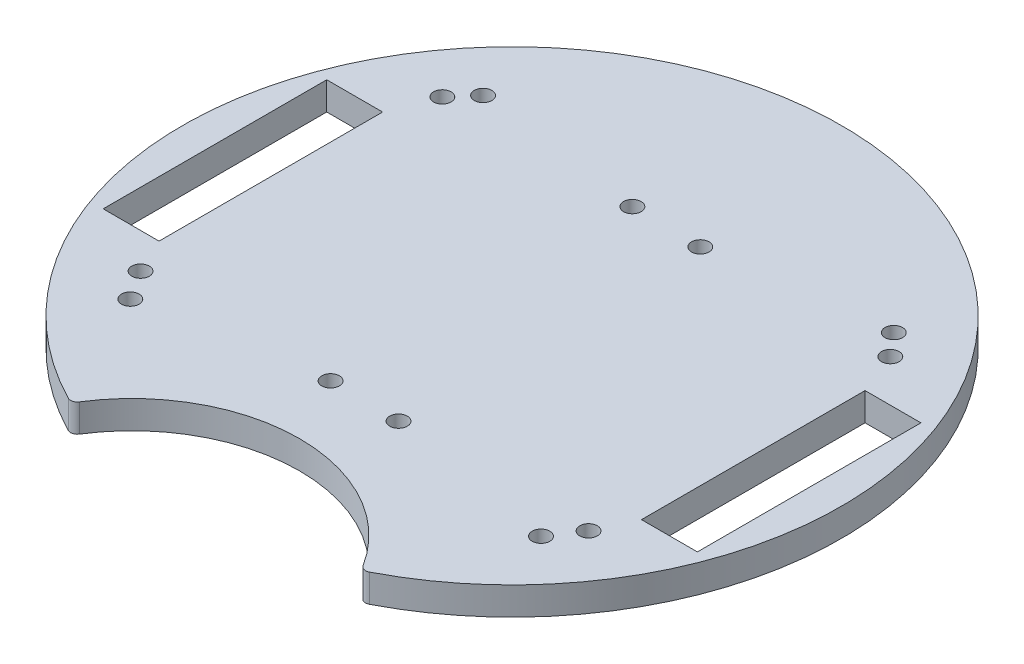
ISO-10303-21;
HEADER;
FILE_DESCRIPTION(('STEP AP214'),'2;1');
FILE_NAME('part.step','',(''),(''),'','','');
FILE_SCHEMA(('AUTOMOTIVE_DESIGN { 1 0 10303 214 1 1 1 1 }'));
ENDSEC;
DATA;
#1=APPLICATION_CONTEXT('core data for automotive mechanical design processes');
#2=APPLICATION_PROTOCOL_DEFINITION('international standard','automotive_design',2000,#1);
#3=PRODUCT_CONTEXT('',#1,'mechanical');
#4=PRODUCT('Part','Part','',(#3));
#5=PRODUCT_RELATED_PRODUCT_CATEGORY('part','',(#4));
#6=PRODUCT_DEFINITION_FORMATION('','',#4);
#7=PRODUCT_DEFINITION_CONTEXT('part definition',#1,'design');
#8=PRODUCT_DEFINITION('design','',#6,#7);
#9=PRODUCT_DEFINITION_SHAPE('','',#8);
#10=(LENGTH_UNIT() NAMED_UNIT(*) SI_UNIT(.MILLI.,.METRE.));
#11=(NAMED_UNIT(*) PLANE_ANGLE_UNIT() SI_UNIT($,.RADIAN.));
#12=(NAMED_UNIT(*) SI_UNIT($,.STERADIAN.) SOLID_ANGLE_UNIT());
#13=UNCERTAINTY_MEASURE_WITH_UNIT(LENGTH_MEASURE(1.E-05),#10,'distance_accuracy_value','');
#14=(GEOMETRIC_REPRESENTATION_CONTEXT(3) GLOBAL_UNCERTAINTY_ASSIGNED_CONTEXT((#13)) GLOBAL_UNIT_ASSIGNED_CONTEXT((#10,
#11,#12)) REPRESENTATION_CONTEXT('',''));
#15=CARTESIAN_POINT('',(0.,0.,0.));
#16=DIRECTION('',(0.,0.,1.));
#17=DIRECTION('',(1.,0.,0.));
#18=AXIS2_PLACEMENT_3D('',#15,#16,#17);
#19=CARTESIAN_POINT('',(67.5141237268841,6.35,0.));
#20=DIRECTION('',(-1.,0.,0.));
#21=DIRECTION('',(0.,0.,1.));
#22=AXIS2_PLACEMENT_3D('',#19,#20,#21);
#23=PLANE('',#22);
#24=DIRECTION('',(0.,0.,-1.));
#25=VECTOR('',#24,1.);
#26=CARTESIAN_POINT('',(67.5141237268841,0.,0.));
#27=LINE('',#26,#25);
#28=CARTESIAN_POINT('',(67.5141237268841,0.,25.3999999999999));
#29=VERTEX_POINT('',#28);
#30=CARTESIAN_POINT('',(67.5141237268841,0.,-25.4000000000001));
#31=VERTEX_POINT('',#30);
#32=EDGE_CURVE('E232',#29,#31,#27,.T.);
#33=ORIENTED_EDGE('',*,*,#32,.F.);
#34=DIRECTION('',(0.,-1.,0.));
#35=VECTOR('',#34,1.);
#36=CARTESIAN_POINT('',(67.5141237268841,6.35,25.3999999999999));
#37=LINE('',#36,#35);
#38=CARTESIAN_POINT('',(67.5141237268841,6.35,25.3999999999999));
#39=VERTEX_POINT('',#38);
#40=EDGE_CURVE('E11',#39,#29,#37,.T.);
#41=ORIENTED_EDGE('',*,*,#40,.F.);
#42=DIRECTION('',(0.,0.,-1.));
#43=VECTOR('',#42,1.);
#44=CARTESIAN_POINT('',(67.5141237268841,6.35,0.));
#45=LINE('',#44,#43);
#46=CARTESIAN_POINT('',(67.5141237268841,6.35,-25.4000000000001));
#47=VERTEX_POINT('',#46);
#48=EDGE_CURVE('E147',#39,#47,#45,.T.);
#49=ORIENTED_EDGE('',*,*,#48,.T.);
#50=DIRECTION('',(0.,-1.,0.));
#51=VECTOR('',#50,1.);
#52=CARTESIAN_POINT('',(67.5141237268841,6.35,-25.4000000000001));
#53=LINE('',#52,#51);
#54=EDGE_CURVE('E56',#47,#31,#53,.T.);
#55=ORIENTED_EDGE('',*,*,#54,.T.);
#56=EDGE_LOOP('',(#33,#41,#49,#55));
#57=FACE_BOUND('',#56,.T.);
#58=ADVANCED_FACE('F37',(#57),#23,.T.);
#59=CARTESIAN_POINT('',(0.,6.35,25.3999999999999));
#60=DIRECTION('',(0.,0.,1.));
#61=DIRECTION('',(1.,0.,0.));
#62=AXIS2_PLACEMENT_3D('',#59,#60,#61);
#63=PLANE('',#62);
#64=DIRECTION('',(-1.,0.,0.));
#65=VECTOR('',#64,1.);
#66=CARTESIAN_POINT('',(0.,0.,25.3999999999999));
#67=LINE('',#66,#65);
#68=CARTESIAN_POINT('',(54.8141237268841,0.,25.3999999999999));
#69=VERTEX_POINT('',#68);
#70=EDGE_CURVE('E152',#29,#69,#67,.T.);
#71=ORIENTED_EDGE('',*,*,#70,.T.);
#72=DIRECTION('',(0.,-1.,0.));
#73=VECTOR('',#72,1.);
#74=CARTESIAN_POINT('',(54.8141237268841,6.35,25.3999999999999));
#75=LINE('',#74,#73);
#76=CARTESIAN_POINT('',(54.8141237268841,6.35,25.3999999999999));
#77=VERTEX_POINT('',#76);
#78=EDGE_CURVE('E47',#77,#69,#75,.T.);
#79=ORIENTED_EDGE('',*,*,#78,.F.);
#80=DIRECTION('',(-1.,0.,0.));
#81=VECTOR('',#80,1.);
#82=CARTESIAN_POINT('',(0.,6.35,25.3999999999999));
#83=LINE('',#82,#81);
#84=EDGE_CURVE('E141',#39,#77,#83,.T.);
#85=ORIENTED_EDGE('',*,*,#84,.F.);
#86=ORIENTED_EDGE('',*,*,#40,.T.);
#87=EDGE_LOOP('',(#71,#79,#85,#86));
#88=FACE_BOUND('',#87,.T.);
#89=ADVANCED_FACE('F150',(#88),#63,.F.);
#90=CARTESIAN_POINT('',(54.8141237268841,6.35,0.));
#91=DIRECTION('',(-1.,0.,0.));
#92=DIRECTION('',(0.,0.,1.));
#93=AXIS2_PLACEMENT_3D('',#90,#91,#92);
#94=PLANE('',#93);
#95=DIRECTION('',(0.,0.,-1.));
#96=VECTOR('',#95,1.);
#97=CARTESIAN_POINT('',(54.8141237268841,0.,0.));
#98=LINE('',#97,#96);
#99=CARTESIAN_POINT('',(54.8141237268841,0.,-25.4000000000001));
#100=VERTEX_POINT('',#99);
#101=EDGE_CURVE('E235',#69,#100,#98,.T.);
#102=ORIENTED_EDGE('',*,*,#101,.T.);
#103=DIRECTION('',(0.,-1.,0.));
#104=VECTOR('',#103,1.);
#105=CARTESIAN_POINT('',(54.8141237268841,6.35,-25.4000000000001));
#106=LINE('',#105,#104);
#107=CARTESIAN_POINT('',(54.8141237268841,6.35,-25.4000000000001));
#108=VERTEX_POINT('',#107);
#109=EDGE_CURVE('E94',#108,#100,#106,.T.);
#110=ORIENTED_EDGE('',*,*,#109,.F.);
#111=DIRECTION('',(0.,0.,-1.));
#112=VECTOR('',#111,1.);
#113=CARTESIAN_POINT('',(54.8141237268841,6.35,0.));
#114=LINE('',#113,#112);
#115=EDGE_CURVE('E133',#77,#108,#114,.T.);
#116=ORIENTED_EDGE('',*,*,#115,.F.);
#117=ORIENTED_EDGE('',*,*,#78,.T.);
#118=EDGE_LOOP('',(#102,#110,#116,#117));
#119=FACE_BOUND('',#118,.T.);
#120=ADVANCED_FACE('F135',(#119),#94,.F.);
#121=CARTESIAN_POINT('',(0.,6.35,-25.4000000000001));
#122=DIRECTION('',(0.,0.,-1.));
#123=DIRECTION('',(-1.,0.,0.));
#124=AXIS2_PLACEMENT_3D('',#121,#122,#123);
#125=PLANE('',#124);
#126=DIRECTION('',(1.,0.,0.));
#127=VECTOR('',#126,1.);
#128=CARTESIAN_POINT('',(0.,0.,-25.4000000000001));
#129=LINE('',#128,#127);
#130=CARTESIAN_POINT('',(-67.5141237268841,0.,-25.4000000000001));
#131=VERTEX_POINT('',#130);
#132=CARTESIAN_POINT('',(-54.8141237268841,0.,-25.4000000000001));
#133=VERTEX_POINT('',#132);
#134=EDGE_CURVE('E221',#131,#133,#129,.T.);
#135=ORIENTED_EDGE('',*,*,#134,.T.);
#136=DIRECTION('',(0.,-1.,0.));
#137=VECTOR('',#136,1.);
#138=CARTESIAN_POINT('',(-54.8141237268841,6.35,-25.4000000000001));
#139=LINE('',#138,#137);
#140=CARTESIAN_POINT('',(-54.8141237268841,6.35,-25.4000000000001));
#141=VERTEX_POINT('',#140);
#142=EDGE_CURVE('E164',#141,#133,#139,.T.);
#143=ORIENTED_EDGE('',*,*,#142,.F.);
#144=DIRECTION('',(1.,0.,0.));
#145=VECTOR('',#144,1.);
#146=CARTESIAN_POINT('',(0.,6.35,-25.4000000000001));
#147=LINE('',#146,#145);
#148=CARTESIAN_POINT('',(-67.5141237268841,6.35,-25.4000000000001));
#149=VERTEX_POINT('',#148);
#150=EDGE_CURVE('E288',#149,#141,#147,.T.);
#151=ORIENTED_EDGE('',*,*,#150,.F.);
#152=DIRECTION('',(0.,-1.,0.));
#153=VECTOR('',#152,1.);
#154=CARTESIAN_POINT('',(-67.5141237268841,6.35,-25.4000000000001));
#155=LINE('',#154,#153);
#156=EDGE_CURVE('E157',#149,#131,#155,.T.);
#157=ORIENTED_EDGE('',*,*,#156,.T.);
#158=EDGE_LOOP('',(#135,#143,#151,#157));
#159=FACE_BOUND('',#158,.T.);
#160=ADVANCED_FACE('F348',(#159),#125,.F.);
#161=CARTESIAN_POINT('',(-54.8141237268841,6.35,0.));
#162=DIRECTION('',(1.,0.,0.));
#163=DIRECTION('',(0.,0.,-1.));
#164=AXIS2_PLACEMENT_3D('',#161,#162,#163);
#165=PLANE('',#164);
#166=DIRECTION('',(0.,0.,1.));
#167=VECTOR('',#166,1.);
#168=CARTESIAN_POINT('',(-54.8141237268841,0.,0.));
#169=LINE('',#168,#167);
#170=CARTESIAN_POINT('',(-54.8141237268841,0.,25.3999999999999));
#171=VERTEX_POINT('',#170);
#172=EDGE_CURVE('E224',#133,#171,#169,.T.);
#173=ORIENTED_EDGE('',*,*,#172,.T.);
#174=DIRECTION('',(0.,-1.,0.));
#175=VECTOR('',#174,1.);
#176=CARTESIAN_POINT('',(-54.8141237268841,6.35,25.3999999999999));
#177=LINE('',#176,#175);
#178=CARTESIAN_POINT('',(-54.8141237268841,6.35,25.3999999999999));
#179=VERTEX_POINT('',#178);
#180=EDGE_CURVE('E162',#179,#171,#177,.T.);
#181=ORIENTED_EDGE('',*,*,#180,.F.);
#182=DIRECTION('',(0.,0.,1.));
#183=VECTOR('',#182,1.);
#184=CARTESIAN_POINT('',(-54.8141237268841,6.35,0.));
#185=LINE('',#184,#183);
#186=EDGE_CURVE('E291',#141,#179,#185,.T.);
#187=ORIENTED_EDGE('',*,*,#186,.F.);
#188=ORIENTED_EDGE('',*,*,#142,.T.);
#189=EDGE_LOOP('',(#173,#181,#187,#188));
#190=FACE_BOUND('',#189,.T.);
#191=ADVANCED_FACE('F344',(#190),#165,.F.);
#192=CARTESIAN_POINT('',(0.,6.35,25.3999999999999));
#193=DIRECTION('',(0.,0.,-1.));
#194=DIRECTION('',(-1.,0.,0.));
#195=AXIS2_PLACEMENT_3D('',#192,#193,#194);
#196=PLANE('',#195);
#197=DIRECTION('',(1.,0.,0.));
#198=VECTOR('',#197,1.);
#199=CARTESIAN_POINT('',(0.,0.,25.3999999999999));
#200=LINE('',#199,#198);
#201=CARTESIAN_POINT('',(-67.5141237268841,0.,25.3999999999999));
#202=VERTEX_POINT('',#201);
#203=EDGE_CURVE('E227',#202,#171,#200,.T.);
#204=ORIENTED_EDGE('',*,*,#203,.F.);
#205=DIRECTION('',(0.,-1.,0.));
#206=VECTOR('',#205,1.);
#207=CARTESIAN_POINT('',(-67.5141237268841,6.35,25.3999999999999));
#208=LINE('',#207,#206);
#209=CARTESIAN_POINT('',(-67.5141237268841,6.35,25.3999999999999));
#210=VERTEX_POINT('',#209);
#211=EDGE_CURVE('E160',#210,#202,#208,.T.);
#212=ORIENTED_EDGE('',*,*,#211,.F.);
#213=DIRECTION('',(1.,0.,0.));
#214=VECTOR('',#213,1.);
#215=CARTESIAN_POINT('',(0.,6.35,25.3999999999999));
#216=LINE('',#215,#214);
#217=EDGE_CURVE('E293',#210,#179,#216,.T.);
#218=ORIENTED_EDGE('',*,*,#217,.T.);
#219=ORIENTED_EDGE('',*,*,#180,.T.);
#220=EDGE_LOOP('',(#204,#212,#218,#219));
#221=FACE_BOUND('',#220,.T.);
#222=ADVANCED_FACE('F341',(#221),#196,.T.);
#223=CARTESIAN_POINT('',(33.5100001196225,6.35,65.3012960955778));
#224=DIRECTION('',(0.,-1.,0.));
#225=DIRECTION('',(0.,0.,-1.));
#226=AXIS2_PLACEMENT_3D('',#223,#224,#225);
#227=CYLINDRICAL_SURFACE('',#226,1.50000000000011);
#228=CARTESIAN_POINT('',(33.5100001196225,0.,65.3012960955778));
#229=DIRECTION('',(0.,1.,0.));
#230=DIRECTION('',(0.,0.,1.));
#231=AXIS2_PLACEMENT_3D('',#228,#229,#230);
#232=CIRCLE('',#231,1.50000000000011);
#233=CARTESIAN_POINT('',(34.1948335778492,0.,66.6358383895849));
#234=VERTEX_POINT('',#233);
#235=CARTESIAN_POINT('',(32.2406819332729,0.,66.100565350462));
#236=VERTEX_POINT('',#235);
#237=EDGE_CURVE('E189',#234,#236,#232,.F.);
#238=ORIENTED_EDGE('',*,*,#237,.F.);
#239=DIRECTION('',(0.,-1.,0.));
#240=VECTOR('',#239,1.);
#241=CARTESIAN_POINT('',(34.1948335778492,6.35,66.6358383895849));
#242=LINE('',#241,#240);
#243=CARTESIAN_POINT('',(34.1948335778492,6.35,66.6358383895849));
#244=VERTEX_POINT('',#243);
#245=EDGE_CURVE('E41',#244,#234,#242,.T.);
#246=ORIENTED_EDGE('',*,*,#245,.F.);
#247=CARTESIAN_POINT('',(33.5100001196225,6.35,65.3012960955778));
#248=DIRECTION('',(0.,1.,0.));
#249=DIRECTION('',(0.,0.,1.));
#250=AXIS2_PLACEMENT_3D('',#247,#248,#249);
#251=CIRCLE('',#250,1.50000000000011);
#252=CARTESIAN_POINT('',(32.2406819332729,6.35,66.100565350462));
#253=VERTEX_POINT('',#252);
#254=EDGE_CURVE('E258',#244,#253,#251,.F.);
#255=ORIENTED_EDGE('',*,*,#254,.T.);
#256=DIRECTION('',(0.,-1.,0.));
#257=VECTOR('',#256,1.);
#258=CARTESIAN_POINT('',(32.2406819332729,6.35,66.100565350462));
#259=LINE('',#258,#257);
#260=EDGE_CURVE('E167',#253,#236,#259,.T.);
#261=ORIENTED_EDGE('',*,*,#260,.T.);
#262=EDGE_LOOP('',(#238,#246,#255,#261));
#263=FACE_BOUND('',#262,.T.);
#264=ADVANCED_FACE('F193',(#263),#227,.T.);
#265=CARTESIAN_POINT('',(0.,6.35,0.));
#266=DIRECTION('',(0.,-1.,0.));
#267=DIRECTION('',(0.,0.,-1.));
#268=AXIS2_PLACEMENT_3D('',#265,#266,#267);
#269=CYLINDRICAL_SURFACE('',#268,74.8974071734108);
#270=CARTESIAN_POINT('',(0.,0.,0.));
#271=DIRECTION('',(0.,1.,0.));
#272=DIRECTION('',(0.,0.,1.));
#273=AXIS2_PLACEMENT_3D('',#270,#271,#272);
#274=CIRCLE('',#273,74.8974071734108);
#275=CARTESIAN_POINT('',(-34.1948335778492,0.,66.6358383895849));
#276=VERTEX_POINT('',#275);
#277=EDGE_CURVE('E180',#234,#276,#274,.T.);
#278=ORIENTED_EDGE('',*,*,#277,.T.);
#279=DIRECTION('',(0.,-1.,0.));
#280=VECTOR('',#279,1.);
#281=CARTESIAN_POINT('',(-34.1948335778492,6.35,66.6358383895849));
#282=LINE('',#281,#280);
#283=CARTESIAN_POINT('',(-34.1948335778492,6.35,66.6358383895849));
#284=VERTEX_POINT('',#283);
#285=EDGE_CURVE('E171',#284,#276,#282,.T.);
#286=ORIENTED_EDGE('',*,*,#285,.F.);
#287=CARTESIAN_POINT('',(0.,6.35,0.));
#288=DIRECTION('',(0.,1.,0.));
#289=DIRECTION('',(0.,0.,1.));
#290=AXIS2_PLACEMENT_3D('',#287,#288,#289);
#291=CIRCLE('',#290,74.8974071734108);
#292=EDGE_CURVE('E182',#244,#284,#291,.T.);
#293=ORIENTED_EDGE('',*,*,#292,.F.);
#294=ORIENTED_EDGE('',*,*,#245,.T.);
#295=EDGE_LOOP('',(#278,#286,#293,#294));
#296=FACE_BOUND('',#295,.T.);
#297=ADVANCED_FACE('F179',(#296),#269,.T.);
#298=CARTESIAN_POINT('',(-33.5100001196225,6.35,65.3012960955779));
#299=DIRECTION('',(0.,-1.,0.));
#300=DIRECTION('',(0.,0.,-1.));
#301=AXIS2_PLACEMENT_3D('',#298,#299,#300);
#302=CYLINDRICAL_SURFACE('',#301,1.50000000000026);
#303=CARTESIAN_POINT('',(-33.5100001196225,0.,65.3012960955779));
#304=DIRECTION('',(0.,1.,0.));
#305=DIRECTION('',(0.,0.,1.));
#306=AXIS2_PLACEMENT_3D('',#303,#304,#305);
#307=CIRCLE('',#306,1.50000000000026);
#308=CARTESIAN_POINT('',(-32.2406819332729,0.,66.100565350462));
#309=VERTEX_POINT('',#308);
#310=EDGE_CURVE('E191',#276,#309,#307,.T.);
#311=ORIENTED_EDGE('',*,*,#310,.T.);
#312=DIRECTION('',(0.,-1.,0.));
#313=VECTOR('',#312,1.);
#314=CARTESIAN_POINT('',(-32.2406819332729,6.35,66.100565350462));
#315=LINE('',#314,#313);
#316=CARTESIAN_POINT('',(-32.2406819332729,6.35,66.100565350462));
#317=VERTEX_POINT('',#316);
#318=EDGE_CURVE('E169',#317,#309,#315,.T.);
#319=ORIENTED_EDGE('',*,*,#318,.F.);
#320=CARTESIAN_POINT('',(-33.5100001196225,6.35,65.3012960955779));
#321=DIRECTION('',(0.,1.,0.));
#322=DIRECTION('',(0.,0.,1.));
#323=AXIS2_PLACEMENT_3D('',#320,#321,#322);
#324=CIRCLE('',#323,1.50000000000026);
#325=EDGE_CURVE('E265',#284,#317,#324,.T.);
#326=ORIENTED_EDGE('',*,*,#325,.F.);
#327=ORIENTED_EDGE('',*,*,#285,.T.);
#328=EDGE_LOOP('',(#311,#319,#326,#327));
#329=FACE_BOUND('',#328,.T.);
#330=ADVANCED_FACE('F379',(#329),#302,.T.);
#331=CARTESIAN_POINT('',(-51.0041237268841,6.35,-35.1655420262204));
#332=DIRECTION('',(0.,-1.,0.));
#333=DIRECTION('',(0.,0.,-1.));
#334=AXIS2_PLACEMENT_3D('',#331,#332,#333);
#335=CYLINDRICAL_SURFACE('',#334,2.);
#336=CARTESIAN_POINT('',(-51.0041237268841,6.35,-35.1655420262204));
#337=DIRECTION('',(0.,1.,0.));
#338=DIRECTION('',(0.,0.,1.));
#339=AXIS2_PLACEMENT_3D('',#336,#337,#338);
#340=CIRCLE('',#339,2.);
#341=CARTESIAN_POINT('',(-51.0041237268841,6.35,-33.1655420262204));
#342=VERTEX_POINT('',#341);
#343=EDGE_CURVE('E309',#342,#342,#340,.F.);
#344=ORIENTED_EDGE('',*,*,#343,.F.);
#345=EDGE_LOOP('',(#344));
#346=FACE_BOUND('',#345,.T.);
#347=CARTESIAN_POINT('',(-51.0041237268841,0.,-35.1655420262204));
#348=DIRECTION('',(0.,1.,0.));
#349=DIRECTION('',(0.,0.,1.));
#350=AXIS2_PLACEMENT_3D('',#347,#348,#349);
#351=CIRCLE('',#350,2.);
#352=CARTESIAN_POINT('',(-51.0041237268841,0.,-33.1655420262204));
#353=VERTEX_POINT('',#352);
#354=EDGE_CURVE('E249',#353,#353,#351,.F.);
#355=ORIENTED_EDGE('',*,*,#354,.T.);
#356=EDGE_LOOP('',(#355));
#357=FACE_BOUND('',#356,.T.);
#358=ADVANCED_FACE('F382',(#346,#357),#335,.F.);
#359=CARTESIAN_POINT('',(-7.82412372688412,6.35,-35.1655420262204));
#360=DIRECTION('',(0.,-1.,0.));
#361=DIRECTION('',(0.,0.,-1.));
#362=AXIS2_PLACEMENT_3D('',#359,#360,#361);
#363=CYLINDRICAL_SURFACE('',#362,2.00000000000001);
#364=CARTESIAN_POINT('',(-7.82412372688412,6.35,-35.1655420262204));
#365=DIRECTION('',(0.,1.,0.));
#366=DIRECTION('',(0.,0.,1.));
#367=AXIS2_PLACEMENT_3D('',#364,#365,#366);
#368=CIRCLE('',#367,2.00000000000001);
#369=CARTESIAN_POINT('',(-7.82412372688412,6.35,-33.1655420262204));
#370=VERTEX_POINT('',#369);
#371=EDGE_CURVE('E306',#370,#370,#368,.F.);
#372=ORIENTED_EDGE('',*,*,#371,.F.);
#373=EDGE_LOOP('',(#372));
#374=FACE_BOUND('',#373,.T.);
#375=CARTESIAN_POINT('',(-7.82412372688412,0.,-35.1655420262204));
#376=DIRECTION('',(0.,1.,0.));
#377=DIRECTION('',(0.,0.,1.));
#378=AXIS2_PLACEMENT_3D('',#375,#376,#377);
#379=CIRCLE('',#378,2.00000000000001);
#380=CARTESIAN_POINT('',(-7.82412372688412,0.,-33.1655420262204));
#381=VERTEX_POINT('',#380);
#382=EDGE_CURVE('E246',#381,#381,#379,.F.);
#383=ORIENTED_EDGE('',*,*,#382,.T.);
#384=EDGE_LOOP('',(#383));
#385=FACE_BOUND('',#384,.T.);
#386=ADVANCED_FACE('F404',(#374,#385),#363,.F.);
#387=CARTESIAN_POINT('',(51.0041237268841,6.35,33.6239560533851));
#388=DIRECTION('',(0.,-1.,0.));
#389=DIRECTION('',(0.,0.,-1.));
#390=AXIS2_PLACEMENT_3D('',#387,#388,#389);
#391=CYLINDRICAL_SURFACE('',#390,2.);
#392=CARTESIAN_POINT('',(51.0041237268841,6.35,33.6239560533851));
#393=DIRECTION('',(0.,1.,0.));
#394=DIRECTION('',(0.,0.,1.));
#395=AXIS2_PLACEMENT_3D('',#392,#393,#394);
#396=CIRCLE('',#395,2.);
#397=CARTESIAN_POINT('',(51.0041237268841,6.35,35.6239560533851));
#398=VERTEX_POINT('',#397);
#399=EDGE_CURVE('E303',#398,#398,#396,.F.);
#400=ORIENTED_EDGE('',*,*,#399,.F.);
#401=EDGE_LOOP('',(#400));
#402=FACE_BOUND('',#401,.T.);
#403=CARTESIAN_POINT('',(51.0041237268841,0.,33.6239560533851));
#404=DIRECTION('',(0.,1.,0.));
#405=DIRECTION('',(0.,0.,1.));
#406=AXIS2_PLACEMENT_3D('',#403,#404,#405);
#407=CIRCLE('',#406,2.);
#408=CARTESIAN_POINT('',(51.0041237268841,0.,35.6239560533851));
#409=VERTEX_POINT('',#408);
#410=EDGE_CURVE('E243',#409,#409,#407,.F.);
#411=ORIENTED_EDGE('',*,*,#410,.T.);
#412=EDGE_LOOP('',(#411));
#413=FACE_BOUND('',#412,.T.);
#414=ADVANCED_FACE('F411',(#402,#413),#391,.F.);
#415=CARTESIAN_POINT('',(7.82412372688412,6.35,33.6239560533851));
#416=DIRECTION('',(0.,-1.,0.));
#417=DIRECTION('',(0.,0.,-1.));
#418=AXIS2_PLACEMENT_3D('',#415,#416,#417);
#419=CYLINDRICAL_SURFACE('',#418,2.);
#420=CARTESIAN_POINT('',(7.82412372688412,6.35,33.6239560533851));
#421=DIRECTION('',(0.,1.,0.));
#422=DIRECTION('',(0.,0.,1.));
#423=AXIS2_PLACEMENT_3D('',#420,#421,#422);
#424=CIRCLE('',#423,2.);
#425=CARTESIAN_POINT('',(7.82412372688412,6.35,35.6239560533851));
#426=VERTEX_POINT('',#425);
#427=EDGE_CURVE('E300',#426,#426,#424,.T.);
#428=ORIENTED_EDGE('',*,*,#427,.T.);
#429=EDGE_LOOP('',(#428));
#430=FACE_BOUND('',#429,.T.);
#431=CARTESIAN_POINT('',(7.82412372688412,0.,33.6239560533851));
#432=DIRECTION('',(0.,1.,0.));
#433=DIRECTION('',(0.,0.,1.));
#434=AXIS2_PLACEMENT_3D('',#431,#432,#433);
#435=CIRCLE('',#434,2.);
#436=CARTESIAN_POINT('',(7.82412372688412,0.,35.6239560533851));
#437=VERTEX_POINT('',#436);
#438=EDGE_CURVE('E240',#437,#437,#435,.T.);
#439=ORIENTED_EDGE('',*,*,#438,.F.);
#440=EDGE_LOOP('',(#439));
#441=FACE_BOUND('',#440,.T.);
#442=ADVANCED_FACE('F419',(#430,#441),#419,.F.);
#443=CARTESIAN_POINT('',(0.,6.35,-25.4000000000001));
#444=DIRECTION('',(0.,0.,1.));
#445=DIRECTION('',(1.,0.,0.));
#446=AXIS2_PLACEMENT_3D('',#443,#444,#445);
#447=PLANE('',#446);
#448=DIRECTION('',(-1.,0.,0.));
#449=VECTOR('',#448,1.);
#450=CARTESIAN_POINT('',(0.,0.,-25.4000000000001));
#451=LINE('',#450,#449);
#452=EDGE_CURVE('E237',#31,#100,#451,.T.);
#453=ORIENTED_EDGE('',*,*,#452,.F.);
#454=ORIENTED_EDGE('',*,*,#54,.F.);
#455=DIRECTION('',(-1.,0.,0.));
#456=VECTOR('',#455,1.);
#457=CARTESIAN_POINT('',(0.,6.35,-25.4000000000001));
#458=LINE('',#457,#456);
#459=EDGE_CURVE('E140',#47,#108,#458,.T.);
#460=ORIENTED_EDGE('',*,*,#459,.T.);
#461=ORIENTED_EDGE('',*,*,#109,.T.);
#462=EDGE_LOOP('',(#453,#454,#460,#461));
#463=FACE_BOUND('',#462,.T.);
#464=ADVANCED_FACE('F339',(#463),#447,.T.);
#465=CARTESIAN_POINT('',(-67.5141237268841,6.35,0.));
#466=DIRECTION('',(-1.,0.,0.));
#467=DIRECTION('',(0.,0.,1.));
#468=AXIS2_PLACEMENT_3D('',#465,#466,#467);
#469=PLANE('',#468);
#470=DIRECTION('',(0.,0.,-1.));
#471=VECTOR('',#470,1.);
#472=CARTESIAN_POINT('',(-67.5141237268841,0.,0.));
#473=LINE('',#472,#471);
#474=EDGE_CURVE('E230',#202,#131,#473,.T.);
#475=ORIENTED_EDGE('',*,*,#474,.T.);
#476=ORIENTED_EDGE('',*,*,#156,.F.);
#477=DIRECTION('',(0.,0.,-1.));
#478=VECTOR('',#477,1.);
#479=CARTESIAN_POINT('',(-67.5141237268841,6.35,0.));
#480=LINE('',#479,#478);
#481=EDGE_CURVE('E296',#210,#149,#480,.T.);
#482=ORIENTED_EDGE('',*,*,#481,.F.);
#483=ORIENTED_EDGE('',*,*,#211,.T.);
#484=EDGE_LOOP('',(#475,#476,#482,#483));
#485=FACE_BOUND('',#484,.T.);
#486=ADVANCED_FACE('F335',(#485),#469,.F.);
#487=CARTESIAN_POINT('',(-51.0041237268841,6.35,33.4144579737796));
#488=DIRECTION('',(0.,-1.,0.));
#489=DIRECTION('',(0.,0.,-1.));
#490=AXIS2_PLACEMENT_3D('',#487,#488,#489);
#491=CYLINDRICAL_SURFACE('',#490,2.);
#492=CARTESIAN_POINT('',(-51.0041237268841,6.35,33.4144579737796));
#493=DIRECTION('',(0.,1.,0.));
#494=DIRECTION('',(0.,0.,1.));
#495=AXIS2_PLACEMENT_3D('',#492,#493,#494);
#496=CIRCLE('',#495,2.);
#497=CARTESIAN_POINT('',(-51.0041237268841,6.35,35.4144579737796));
#498=VERTEX_POINT('',#497);
#499=EDGE_CURVE('E285',#498,#498,#496,.F.);
#500=ORIENTED_EDGE('',*,*,#499,.F.);
#501=EDGE_LOOP('',(#500));
#502=FACE_BOUND('',#501,.T.);
#503=CARTESIAN_POINT('',(-51.0041237268841,0.,33.4144579737796));
#504=DIRECTION('',(0.,1.,0.));
#505=DIRECTION('',(0.,0.,1.));
#506=AXIS2_PLACEMENT_3D('',#503,#504,#505);
#507=CIRCLE('',#506,2.);
#508=CARTESIAN_POINT('',(-51.0041237268841,0.,35.4144579737796));
#509=VERTEX_POINT('',#508);
#510=EDGE_CURVE('E218',#509,#509,#507,.F.);
#511=ORIENTED_EDGE('',*,*,#510,.T.);
#512=EDGE_LOOP('',(#511));
#513=FACE_BOUND('',#512,.T.);
#514=ADVANCED_FACE('F338',(#502,#513),#491,.F.);
#515=CARTESIAN_POINT('',(51.0041237268841,6.35,-34.9560439466149));
#516=DIRECTION('',(0.,-1.,0.));
#517=DIRECTION('',(0.,0.,-1.));
#518=AXIS2_PLACEMENT_3D('',#515,#516,#517);
#519=CYLINDRICAL_SURFACE('',#518,2.);
#520=CARTESIAN_POINT('',(51.0041237268841,6.35,-34.9560439466149));
#521=DIRECTION('',(0.,1.,0.));
#522=DIRECTION('',(0.,0.,1.));
#523=AXIS2_PLACEMENT_3D('',#520,#521,#522);
#524=CIRCLE('',#523,2.);
#525=CARTESIAN_POINT('',(51.0041237268841,6.35,-32.9560439466149));
#526=VERTEX_POINT('',#525);
#527=EDGE_CURVE('E282',#526,#526,#524,.F.);
#528=ORIENTED_EDGE('',*,*,#527,.F.);
#529=EDGE_LOOP('',(#528));
#530=FACE_BOUND('',#529,.T.);
#531=CARTESIAN_POINT('',(51.0041237268841,0.,-34.9560439466149));
#532=DIRECTION('',(0.,1.,0.));
#533=DIRECTION('',(0.,0.,1.));
#534=AXIS2_PLACEMENT_3D('',#531,#532,#533);
#535=CIRCLE('',#534,2.);
#536=CARTESIAN_POINT('',(51.0041237268841,0.,-32.9560439466149));
#537=VERTEX_POINT('',#536);
#538=EDGE_CURVE('E215',#537,#537,#535,.F.);
#539=ORIENTED_EDGE('',*,*,#538,.T.);
#540=EDGE_LOOP('',(#539));
#541=FACE_BOUND('',#540,.T.);
#542=ADVANCED_FACE('F355',(#530,#541),#519,.F.);
#543=CARTESIAN_POINT('',(-7.82412372688412,6.35,33.4144579737796));
#544=DIRECTION('',(0.,-1.,0.));
#545=DIRECTION('',(0.,0.,-1.));
#546=AXIS2_PLACEMENT_3D('',#543,#544,#545);
#547=CYLINDRICAL_SURFACE('',#546,2.00000000000001);
#548=CARTESIAN_POINT('',(-7.82412372688412,6.35,33.4144579737796));
#549=DIRECTION('',(0.,1.,0.));
#550=DIRECTION('',(0.,0.,1.));
#551=AXIS2_PLACEMENT_3D('',#548,#549,#550);
#552=CIRCLE('',#551,2.00000000000001);
#553=CARTESIAN_POINT('',(-7.82412372688412,6.35,35.4144579737796));
#554=VERTEX_POINT('',#553);
#555=EDGE_CURVE('E279',#554,#554,#552,.F.);
#556=ORIENTED_EDGE('',*,*,#555,.F.);
#557=EDGE_LOOP('',(#556));
#558=FACE_BOUND('',#557,.T.);
#559=CARTESIAN_POINT('',(-7.82412372688412,0.,33.4144579737796));
#560=DIRECTION('',(0.,1.,0.));
#561=DIRECTION('',(0.,0.,1.));
#562=AXIS2_PLACEMENT_3D('',#559,#560,#561);
#563=CIRCLE('',#562,2.00000000000001);
#564=CARTESIAN_POINT('',(-7.82412372688412,0.,35.4144579737796));
#565=VERTEX_POINT('',#564);
#566=EDGE_CURVE('E212',#565,#565,#563,.F.);
#567=ORIENTED_EDGE('',*,*,#566,.T.);
#568=EDGE_LOOP('',(#567));
#569=FACE_BOUND('',#568,.T.);
#570=ADVANCED_FACE('F359',(#558,#569),#547,.F.);
#571=CARTESIAN_POINT('',(-46.6637339832601,6.35,40.0812318826666));
#572=DIRECTION('',(0.,-1.,0.));
#573=DIRECTION('',(0.,0.,-1.));
#574=AXIS2_PLACEMENT_3D('',#571,#572,#573);
#575=CYLINDRICAL_SURFACE('',#574,2.);
#576=CARTESIAN_POINT('',(-46.6637339832601,6.35,40.0812318826666));
#577=DIRECTION('',(0.,1.,0.));
#578=DIRECTION('',(0.,0.,1.));
#579=AXIS2_PLACEMENT_3D('',#576,#577,#578);
#580=CIRCLE('',#579,2.);
#581=CARTESIAN_POINT('',(-46.6637339832601,6.35,42.0812318826666));
#582=VERTEX_POINT('',#581);
#583=EDGE_CURVE('E276',#582,#582,#580,.T.);
#584=ORIENTED_EDGE('',*,*,#583,.T.);
#585=EDGE_LOOP('',(#584));
#586=FACE_BOUND('',#585,.T.);
#587=CARTESIAN_POINT('',(-46.6637339832601,0.,40.0812318826666));
#588=DIRECTION('',(0.,1.,0.));
#589=DIRECTION('',(0.,0.,1.));
#590=AXIS2_PLACEMENT_3D('',#587,#588,#589);
#591=CIRCLE('',#590,2.);
#592=CARTESIAN_POINT('',(-46.6637339832601,0.,42.0812318826666));
#593=VERTEX_POINT('',#592);
#594=EDGE_CURVE('E209',#593,#593,#591,.T.);
#595=ORIENTED_EDGE('',*,*,#594,.F.);
#596=EDGE_LOOP('',(#595));
#597=FACE_BOUND('',#596,.T.);
#598=ADVANCED_FACE('F363',(#586,#597),#575,.F.);
#599=CARTESIAN_POINT('',(46.6637339832601,6.35,40.0812318826666));
#600=DIRECTION('',(0.,-1.,0.));
#601=DIRECTION('',(0.,0.,-1.));
#602=AXIS2_PLACEMENT_3D('',#599,#600,#601);
#603=CYLINDRICAL_SURFACE('',#602,2.);
#604=CARTESIAN_POINT('',(46.6637339832601,6.35,40.0812318826666));
#605=DIRECTION('',(0.,1.,0.));
#606=DIRECTION('',(0.,0.,1.));
#607=AXIS2_PLACEMENT_3D('',#604,#605,#606);
#608=CIRCLE('',#607,2.);
#609=CARTESIAN_POINT('',(46.6637339832601,6.35,42.0812318826666));
#610=VERTEX_POINT('',#609);
#611=EDGE_CURVE('E273',#610,#610,#608,.T.);
#612=ORIENTED_EDGE('',*,*,#611,.T.);
#613=EDGE_LOOP('',(#612));
#614=FACE_BOUND('',#613,.T.);
#615=CARTESIAN_POINT('',(46.6637339832601,0.,40.0812318826666));
#616=DIRECTION('',(0.,1.,0.));
#617=DIRECTION('',(0.,0.,1.));
#618=AXIS2_PLACEMENT_3D('',#615,#616,#617);
#619=CIRCLE('',#618,2.);
#620=CARTESIAN_POINT('',(46.6637339832601,0.,42.0812318826666));
#621=VERTEX_POINT('',#620);
#622=EDGE_CURVE('E206',#621,#621,#619,.T.);
#623=ORIENTED_EDGE('',*,*,#622,.F.);
#624=EDGE_LOOP('',(#623));
#625=FACE_BOUND('',#624,.T.);
#626=ADVANCED_FACE('F367',(#614,#625),#603,.F.);
#627=CARTESIAN_POINT('',(46.6637339832601,6.35,-40.0812318826666));
#628=DIRECTION('',(0.,-1.,0.));
#629=DIRECTION('',(0.,0.,-1.));
#630=AXIS2_PLACEMENT_3D('',#627,#628,#629);
#631=CYLINDRICAL_SURFACE('',#630,2.);
#632=CARTESIAN_POINT('',(46.6637339832601,6.35,-40.0812318826666));
#633=DIRECTION('',(0.,1.,0.));
#634=DIRECTION('',(0.,0.,1.));
#635=AXIS2_PLACEMENT_3D('',#632,#633,#634);
#636=CIRCLE('',#635,2.);
#637=CARTESIAN_POINT('',(46.6637339832601,6.35,-38.0812318826666));
#638=VERTEX_POINT('',#637);
#639=EDGE_CURVE('E270',#638,#638,#636,.F.);
#640=ORIENTED_EDGE('',*,*,#639,.F.);
#641=EDGE_LOOP('',(#640));
#642=FACE_BOUND('',#641,.T.);
#643=CARTESIAN_POINT('',(46.6637339832601,0.,-40.0812318826666));
#644=DIRECTION('',(0.,1.,0.));
#645=DIRECTION('',(0.,0.,1.));
#646=AXIS2_PLACEMENT_3D('',#643,#644,#645);
#647=CIRCLE('',#646,2.);
#648=CARTESIAN_POINT('',(46.6637339832601,0.,-38.0812318826666));
#649=VERTEX_POINT('',#648);
#650=EDGE_CURVE('E203',#649,#649,#647,.F.);
#651=ORIENTED_EDGE('',*,*,#650,.T.);
#652=EDGE_LOOP('',(#651));
#653=FACE_BOUND('',#652,.T.);
#654=ADVANCED_FACE('F371',(#642,#653),#631,.F.);
#655=CARTESIAN_POINT('',(0.,6.35,86.4020044245157));
#656=DIRECTION('',(0.,-1.,0.));
#657=DIRECTION('',(0.,0.,-1.));
#658=AXIS2_PLACEMENT_3D('',#655,#656,#657);
#659=CYLINDRICAL_SURFACE('',#658,38.0999999999998);
#660=CARTESIAN_POINT('',(0.,0.,86.4020044245157));
#661=DIRECTION('',(0.,1.,0.));
#662=DIRECTION('',(0.,0.,1.));
#663=AXIS2_PLACEMENT_3D('',#660,#661,#662);
#664=CIRCLE('',#663,38.0999999999998);
#665=EDGE_CURVE('E201',#236,#309,#664,.T.);
#666=ORIENTED_EDGE('',*,*,#665,.F.);
#667=ORIENTED_EDGE('',*,*,#260,.F.);
#668=CARTESIAN_POINT('',(0.,6.35,86.4020044245157));
#669=DIRECTION('',(0.,1.,0.));
#670=DIRECTION('',(0.,0.,1.));
#671=AXIS2_PLACEMENT_3D('',#668,#669,#670);
#672=CIRCLE('',#671,38.0999999999998);
#673=EDGE_CURVE('E267',#253,#317,#672,.T.);
#674=ORIENTED_EDGE('',*,*,#673,.T.);
#675=ORIENTED_EDGE('',*,*,#318,.T.);
#676=EDGE_LOOP('',(#666,#667,#674,#675));
#677=FACE_BOUND('',#676,.T.);
#678=ADVANCED_FACE('F324',(#677),#659,.F.);
#679=CARTESIAN_POINT('',(7.82412372688412,6.35,-34.9560439466149));
#680=DIRECTION('',(0.,-1.,0.));
#681=DIRECTION('',(0.,0.,-1.));
#682=AXIS2_PLACEMENT_3D('',#679,#680,#681);
#683=CYLINDRICAL_SURFACE('',#682,2.);
#684=CARTESIAN_POINT('',(7.82412372688412,6.35,-34.9560439466149));
#685=DIRECTION('',(0.,1.,0.));
#686=DIRECTION('',(0.,0.,1.));
#687=AXIS2_PLACEMENT_3D('',#684,#685,#686);
#688=CIRCLE('',#687,2.);
#689=CARTESIAN_POINT('',(7.82412372688412,6.35,-32.9560439466149));
#690=VERTEX_POINT('',#689);
#691=EDGE_CURVE('E254',#690,#690,#688,.T.);
#692=ORIENTED_EDGE('',*,*,#691,.T.);
#693=EDGE_LOOP('',(#692));
#694=FACE_BOUND('',#693,.T.);
#695=CARTESIAN_POINT('',(7.82412372688412,0.,-34.9560439466149));
#696=DIRECTION('',(0.,1.,0.));
#697=DIRECTION('',(0.,0.,1.));
#698=AXIS2_PLACEMENT_3D('',#695,#696,#697);
#699=CIRCLE('',#698,2.);
#700=CARTESIAN_POINT('',(7.82412372688412,0.,-32.9560439466149));
#701=VERTEX_POINT('',#700);
#702=EDGE_CURVE('E194',#701,#701,#699,.T.);
#703=ORIENTED_EDGE('',*,*,#702,.F.);
#704=EDGE_LOOP('',(#703));
#705=FACE_BOUND('',#704,.T.);
#706=ADVANCED_FACE('F39',(#694,#705),#683,.F.);
#707=CARTESIAN_POINT('',(-46.6637339832601,6.35,-40.0812318826666));
#708=DIRECTION('',(0.,-1.,0.));
#709=DIRECTION('',(0.,0.,-1.));
#710=AXIS2_PLACEMENT_3D('',#707,#708,#709);
#711=CYLINDRICAL_SURFACE('',#710,2.);
#712=CARTESIAN_POINT('',(-46.6637339832601,6.35,-40.0812318826666));
#713=DIRECTION('',(0.,1.,0.));
#714=DIRECTION('',(0.,0.,1.));
#715=AXIS2_PLACEMENT_3D('',#712,#713,#714);
#716=CIRCLE('',#715,2.);
#717=CARTESIAN_POINT('',(-46.6637339832601,6.35,-38.0812318826666));
#718=VERTEX_POINT('',#717);
#719=EDGE_CURVE('E170',#718,#718,#716,.F.);
#720=ORIENTED_EDGE('',*,*,#719,.F.);
#721=EDGE_LOOP('',(#720));
#722=FACE_BOUND('',#721,.T.);
#723=CARTESIAN_POINT('',(-46.6637339832601,0.,-40.0812318826666));
#724=DIRECTION('',(0.,1.,0.));
#725=DIRECTION('',(0.,0.,1.));
#726=AXIS2_PLACEMENT_3D('',#723,#724,#725);
#727=CIRCLE('',#726,2.);
#728=CARTESIAN_POINT('',(-46.6637339832601,0.,-38.0812318826666));
#729=VERTEX_POINT('',#728);
#730=EDGE_CURVE('E252',#729,#729,#727,.F.);
#731=ORIENTED_EDGE('',*,*,#730,.T.);
#732=EDGE_LOOP('',(#731));
#733=FACE_BOUND('',#732,.T.);
#734=ADVANCED_FACE('F315',(#722,#733),#711,.F.);
#735=CARTESIAN_POINT('',(0.,6.35,0.));
#736=DIRECTION('',(0.,1.,0.));
#737=DIRECTION('',(0.,0.,1.));
#738=AXIS2_PLACEMENT_3D('',#735,#736,#737);
#739=PLANE('',#738);
#740=ORIENTED_EDGE('',*,*,#691,.F.);
#741=EDGE_LOOP('',(#740));
#742=FACE_BOUND('',#741,.T.);
#743=ORIENTED_EDGE('',*,*,#254,.F.);
#744=ORIENTED_EDGE('',*,*,#292,.T.);
#745=ORIENTED_EDGE('',*,*,#325,.T.);
#746=ORIENTED_EDGE('',*,*,#673,.F.);
#747=EDGE_LOOP('',(#743,#744,#745,#746));
#748=FACE_BOUND('',#747,.T.);
#749=ORIENTED_EDGE('',*,*,#639,.T.);
#750=EDGE_LOOP('',(#749));
#751=FACE_BOUND('',#750,.T.);
#752=ORIENTED_EDGE('',*,*,#611,.F.);
#753=EDGE_LOOP('',(#752));
#754=FACE_BOUND('',#753,.T.);
#755=ORIENTED_EDGE('',*,*,#583,.F.);
#756=EDGE_LOOP('',(#755));
#757=FACE_BOUND('',#756,.T.);
#758=ORIENTED_EDGE('',*,*,#555,.T.);
#759=EDGE_LOOP('',(#758));
#760=FACE_BOUND('',#759,.T.);
#761=ORIENTED_EDGE('',*,*,#527,.T.);
#762=EDGE_LOOP('',(#761));
#763=FACE_BOUND('',#762,.T.);
#764=ORIENTED_EDGE('',*,*,#499,.T.);
#765=EDGE_LOOP('',(#764));
#766=FACE_BOUND('',#765,.T.);
#767=ORIENTED_EDGE('',*,*,#150,.T.);
#768=ORIENTED_EDGE('',*,*,#186,.T.);
#769=ORIENTED_EDGE('',*,*,#217,.F.);
#770=ORIENTED_EDGE('',*,*,#481,.T.);
#771=EDGE_LOOP('',(#767,#768,#769,#770));
#772=FACE_BOUND('',#771,.T.);
#773=ORIENTED_EDGE('',*,*,#48,.F.);
#774=ORIENTED_EDGE('',*,*,#84,.T.);
#775=ORIENTED_EDGE('',*,*,#115,.T.);
#776=ORIENTED_EDGE('',*,*,#459,.F.);
#777=EDGE_LOOP('',(#773,#774,#775,#776));
#778=FACE_BOUND('',#777,.T.);
#779=ORIENTED_EDGE('',*,*,#427,.F.);
#780=EDGE_LOOP('',(#779));
#781=FACE_BOUND('',#780,.T.);
#782=ORIENTED_EDGE('',*,*,#399,.T.);
#783=EDGE_LOOP('',(#782));
#784=FACE_BOUND('',#783,.T.);
#785=ORIENTED_EDGE('',*,*,#371,.T.);
#786=EDGE_LOOP('',(#785));
#787=FACE_BOUND('',#786,.T.);
#788=ORIENTED_EDGE('',*,*,#343,.T.);
#789=EDGE_LOOP('',(#788));
#790=FACE_BOUND('',#789,.T.);
#791=ORIENTED_EDGE('',*,*,#719,.T.);
#792=EDGE_LOOP('',(#791));
#793=FACE_BOUND('',#792,.T.);
#794=ADVANCED_FACE('F145',(#742,#748,#751,#754,#757,#760,#763,#766,#772,#778,#781,#784,#787,
#790,#793),#739,.T.);
#795=CARTESIAN_POINT('',(0.,0.,0.));
#796=DIRECTION('',(0.,1.,0.));
#797=DIRECTION('',(0.,0.,1.));
#798=AXIS2_PLACEMENT_3D('',#795,#796,#797);
#799=PLANE('',#798);
#800=ORIENTED_EDGE('',*,*,#702,.T.);
#801=EDGE_LOOP('',(#800));
#802=FACE_BOUND('',#801,.T.);
#803=ORIENTED_EDGE('',*,*,#237,.T.);
#804=ORIENTED_EDGE('',*,*,#665,.T.);
#805=ORIENTED_EDGE('',*,*,#310,.F.);
#806=ORIENTED_EDGE('',*,*,#277,.F.);
#807=EDGE_LOOP('',(#803,#804,#805,#806));
#808=FACE_BOUND('',#807,.T.);
#809=ORIENTED_EDGE('',*,*,#650,.F.);
#810=EDGE_LOOP('',(#809));
#811=FACE_BOUND('',#810,.T.);
#812=ORIENTED_EDGE('',*,*,#622,.T.);
#813=EDGE_LOOP('',(#812));
#814=FACE_BOUND('',#813,.T.);
#815=ORIENTED_EDGE('',*,*,#594,.T.);
#816=EDGE_LOOP('',(#815));
#817=FACE_BOUND('',#816,.T.);
#818=ORIENTED_EDGE('',*,*,#566,.F.);
#819=EDGE_LOOP('',(#818));
#820=FACE_BOUND('',#819,.T.);
#821=ORIENTED_EDGE('',*,*,#538,.F.);
#822=EDGE_LOOP('',(#821));
#823=FACE_BOUND('',#822,.T.);
#824=ORIENTED_EDGE('',*,*,#510,.F.);
#825=EDGE_LOOP('',(#824));
#826=FACE_BOUND('',#825,.T.);
#827=ORIENTED_EDGE('',*,*,#134,.F.);
#828=ORIENTED_EDGE('',*,*,#474,.F.);
#829=ORIENTED_EDGE('',*,*,#203,.T.);
#830=ORIENTED_EDGE('',*,*,#172,.F.);
#831=EDGE_LOOP('',(#827,#828,#829,#830));
#832=FACE_BOUND('',#831,.T.);
#833=ORIENTED_EDGE('',*,*,#32,.T.);
#834=ORIENTED_EDGE('',*,*,#452,.T.);
#835=ORIENTED_EDGE('',*,*,#101,.F.);
#836=ORIENTED_EDGE('',*,*,#70,.F.);
#837=EDGE_LOOP('',(#833,#834,#835,#836));
#838=FACE_BOUND('',#837,.T.);
#839=ORIENTED_EDGE('',*,*,#438,.T.);
#840=EDGE_LOOP('',(#839));
#841=FACE_BOUND('',#840,.T.);
#842=ORIENTED_EDGE('',*,*,#410,.F.);
#843=EDGE_LOOP('',(#842));
#844=FACE_BOUND('',#843,.T.);
#845=ORIENTED_EDGE('',*,*,#382,.F.);
#846=EDGE_LOOP('',(#845));
#847=FACE_BOUND('',#846,.T.);
#848=ORIENTED_EDGE('',*,*,#354,.F.);
#849=EDGE_LOOP('',(#848));
#850=FACE_BOUND('',#849,.T.);
#851=ORIENTED_EDGE('',*,*,#730,.F.);
#852=EDGE_LOOP('',(#851));
#853=FACE_BOUND('',#852,.T.);
#854=ADVANCED_FACE('F186',(#802,#808,#811,#814,#817,#820,#823,#826,#832,#838,#841,#844,#847,
#850,#853),#799,.F.);
#855=CLOSED_SHELL('',(#58,#89,#120,#160,#191,#222,#264,#297,#330,#358,#386,#414,#442,#464,#486,
#514,#542,#570,#598,#626,#654,#678,#706,#734,#794,#854));
#856=MANIFOLD_SOLID_BREP('B2',#855);
#857=ADVANCED_BREP_SHAPE_REPRESENTATION('',(#18,#856),#14);
#858=SHAPE_DEFINITION_REPRESENTATION(#9,#857);
ENDSEC;
END-ISO-10303-21;
